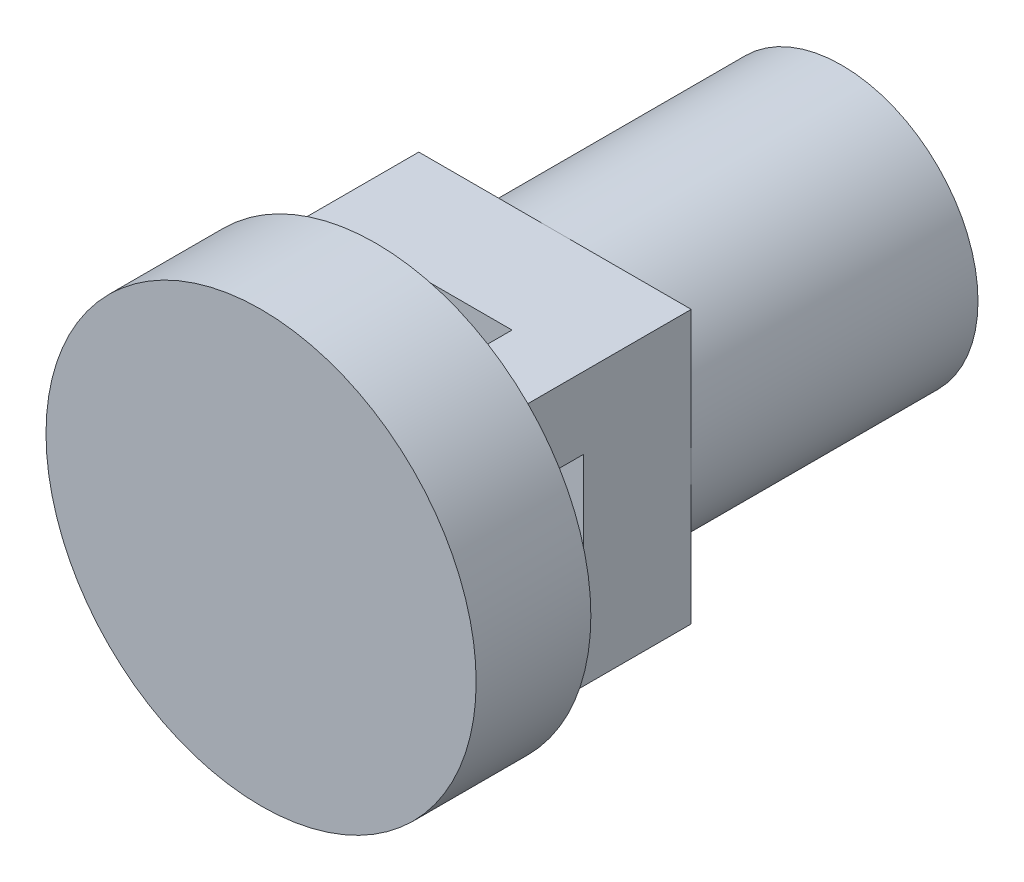
ISO-10303-21;
HEADER;
FILE_DESCRIPTION(('STEP AP214'),'2;1');
FILE_NAME('part.step','',(''),(''),'','','');
FILE_SCHEMA(('AUTOMOTIVE_DESIGN { 1 0 10303 214 1 1 1 1 }'));
ENDSEC;
DATA;
#1=APPLICATION_CONTEXT('core data for automotive mechanical design processes');
#2=APPLICATION_PROTOCOL_DEFINITION('international standard','automotive_design',2000,#1);
#3=PRODUCT_CONTEXT('',#1,'mechanical');
#4=PRODUCT('Part','Part','',(#3));
#5=PRODUCT_RELATED_PRODUCT_CATEGORY('part','',(#4));
#6=PRODUCT_DEFINITION_FORMATION('','',#4);
#7=PRODUCT_DEFINITION_CONTEXT('part definition',#1,'design');
#8=PRODUCT_DEFINITION('design','',#6,#7);
#9=PRODUCT_DEFINITION_SHAPE('','',#8);
#10=(LENGTH_UNIT() NAMED_UNIT(*) SI_UNIT(.MILLI.,.METRE.));
#11=(NAMED_UNIT(*) PLANE_ANGLE_UNIT() SI_UNIT($,.RADIAN.));
#12=(NAMED_UNIT(*) SI_UNIT($,.STERADIAN.) SOLID_ANGLE_UNIT());
#13=UNCERTAINTY_MEASURE_WITH_UNIT(LENGTH_MEASURE(1.E-05),#10,'distance_accuracy_value','');
#14=(GEOMETRIC_REPRESENTATION_CONTEXT(3) GLOBAL_UNCERTAINTY_ASSIGNED_CONTEXT((#13)) GLOBAL_UNIT_ASSIGNED_CONTEXT((#10,
#11,#12)) REPRESENTATION_CONTEXT('',''));
#15=CARTESIAN_POINT('',(0.,0.,0.));
#16=DIRECTION('',(0.,0.,1.));
#17=DIRECTION('',(1.,0.,0.));
#18=AXIS2_PLACEMENT_3D('',#15,#16,#17);
#19=CARTESIAN_POINT('',(3.00000508001016,3.00000508001016,-5.5));
#20=DIRECTION('',(0.,0.,1.));
#21=DIRECTION('',(1.,0.,0.));
#22=AXIS2_PLACEMENT_3D('',#19,#20,#21);
#23=CYLINDRICAL_SURFACE('',#22,0.601590178307734);
#24=CARTESIAN_POINT('',(3.00000508001016,3.00000508001016,-5.5));
#25=DIRECTION('',(0.,0.,-1.));
#26=DIRECTION('',(-1.,0.,0.));
#27=AXIS2_PLACEMENT_3D('',#24,#25,#26);
#28=CIRCLE('',#27,0.601590178307734);
#29=CARTESIAN_POINT('',(2.88467906805182,2.40957248131483,-5.5));
#30=VERTEX_POINT('',#29);
#31=CARTESIAN_POINT('',(2.88467906805182,3.59043767870549,-5.5));
#32=VERTEX_POINT('',#31);
#33=EDGE_CURVE('E236',#30,#32,#28,.T.);
#34=ORIENTED_EDGE('',*,*,#33,.F.);
#35=DIRECTION('',(0.,0.,1.));
#36=VECTOR('',#35,1.);
#37=CARTESIAN_POINT('',(2.88467906805182,2.40957248131483,-5.5));
#38=LINE('',#37,#36);
#39=CARTESIAN_POINT('',(2.88467906805182,2.40957248131483,-2.5));
#40=VERTEX_POINT('',#39);
#41=EDGE_CURVE('E538',#30,#40,#38,.T.);
#42=ORIENTED_EDGE('',*,*,#41,.T.);
#43=CARTESIAN_POINT('',(3.00000508001016,3.00000508001016,-2.5));
#44=DIRECTION('',(0.,0.,-1.));
#45=DIRECTION('',(-1.,0.,0.));
#46=AXIS2_PLACEMENT_3D('',#43,#44,#45);
#47=CIRCLE('',#46,0.601590178307734);
#48=CARTESIAN_POINT('',(2.88467906805182,3.59043767870549,-2.5));
#49=VERTEX_POINT('',#48);
#50=EDGE_CURVE('E247',#40,#49,#47,.T.);
#51=ORIENTED_EDGE('',*,*,#50,.T.);
#52=DIRECTION('',(0.,0.,1.));
#53=VECTOR('',#52,1.);
#54=CARTESIAN_POINT('',(2.88467906805182,3.59043767870549,-5.5));
#55=LINE('',#54,#53);
#56=EDGE_CURVE('E541',#49,#32,#55,.F.);
#57=ORIENTED_EDGE('',*,*,#56,.T.);
#58=EDGE_LOOP('',(#34,#42,#51,#57));
#59=FACE_BOUND('',#58,.T.);
#60=ADVANCED_FACE('F34',(#59),#23,.T.);
#61=CARTESIAN_POINT('',(3.00000508001016,3.00000508001016,-5.5));
#62=DIRECTION('',(0.,0.,-1.));
#63=DIRECTION('',(-1.,0.,0.));
#64=AXIS2_PLACEMENT_3D('',#61,#62,#63);
#65=PLANE('',#64);
#66=DIRECTION('',(0.,1.,0.));
#67=VECTOR('',#66,1.);
#68=CARTESIAN_POINT('',(2.88467906805182,2.16836654740901,-5.5));
#69=LINE('',#68,#67);
#70=CARTESIAN_POINT('',(2.88467906805182,2.71594913164705,-5.5));
#71=VERTEX_POINT('',#70);
#72=EDGE_CURVE('E560',#30,#71,#69,.T.);
#73=ORIENTED_EDGE('',*,*,#72,.F.);
#74=ORIENTED_EDGE('',*,*,#33,.T.);
#75=CARTESIAN_POINT('',(2.88467906805182,3.28406102837327,-5.5));
#76=VERTEX_POINT('',#75);
#77=EDGE_CURVE('E561',#76,#32,#69,.T.);
#78=ORIENTED_EDGE('',*,*,#77,.F.);
#79=CARTESIAN_POINT('',(3.00000508001016,3.00000508001016,-5.5));
#80=DIRECTION('',(0.,0.,-1.));
#81=DIRECTION('',(-1.,0.,0.));
#82=AXIS2_PLACEMENT_3D('',#79,#80,#81);
#83=CIRCLE('',#82,0.30657441320939);
#84=EDGE_CURVE('E245',#71,#76,#83,.T.);
#85=ORIENTED_EDGE('',*,*,#84,.F.);
#86=EDGE_LOOP('',(#73,#74,#78,#85));
#87=FACE_BOUND('',#86,.T.);
#88=ADVANCED_FACE('F488',(#87),#65,.T.);
#89=CARTESIAN_POINT('',(3.00000508001016,3.00000508001016,-2.5));
#90=DIRECTION('',(0.,0.,-1.));
#91=DIRECTION('',(-1.,0.,0.));
#92=AXIS2_PLACEMENT_3D('',#89,#90,#91);
#93=CYLINDRICAL_SURFACE('',#92,0.30657441320939);
#94=ORIENTED_EDGE('',*,*,#84,.T.);
#95=DIRECTION('',(0.,0.,-1.));
#96=VECTOR('',#95,1.);
#97=CARTESIAN_POINT('',(2.88467906805182,3.28406102837327,-2.5));
#98=LINE('',#97,#96);
#99=CARTESIAN_POINT('',(2.88467906805182,3.28406102837327,-2.5));
#100=VERTEX_POINT('',#99);
#101=EDGE_CURVE('E535',#76,#100,#98,.F.);
#102=ORIENTED_EDGE('',*,*,#101,.T.);
#103=CARTESIAN_POINT('',(3.00000508001016,3.00000508001016,-2.5));
#104=DIRECTION('',(0.,0.,-1.));
#105=DIRECTION('',(-1.,0.,0.));
#106=AXIS2_PLACEMENT_3D('',#103,#104,#105);
#107=CIRCLE('',#106,0.30657441320939);
#108=CARTESIAN_POINT('',(2.88467906805182,2.71594913164705,-2.5));
#109=VERTEX_POINT('',#108);
#110=EDGE_CURVE('E539',#109,#100,#107,.T.);
#111=ORIENTED_EDGE('',*,*,#110,.F.);
#112=DIRECTION('',(0.,0.,-1.));
#113=VECTOR('',#112,1.);
#114=CARTESIAN_POINT('',(2.88467906805182,2.71594913164705,-2.5));
#115=LINE('',#114,#113);
#116=EDGE_CURVE('E219',#109,#71,#115,.T.);
#117=ORIENTED_EDGE('',*,*,#116,.T.);
#118=EDGE_LOOP('',(#94,#102,#111,#117));
#119=FACE_BOUND('',#118,.T.);
#120=ADVANCED_FACE('F494',(#119),#93,.F.);
#121=CARTESIAN_POINT('',(0.,0.,-2.5));
#122=DIRECTION('',(0.,0.,-1.));
#123=DIRECTION('',(-1.,0.,0.));
#124=AXIS2_PLACEMENT_3D('',#121,#122,#123);
#125=PLANE('',#124);
#126=CARTESIAN_POINT('',(3.00000508001016,3.00000508001016,-2.5));
#127=DIRECTION('',(0.,0.,-1.));
#128=DIRECTION('',(-1.,0.,0.));
#129=AXIS2_PLACEMENT_3D('',#126,#127,#128);
#130=CIRCLE('',#129,1.9000508001016);
#131=CARTESIAN_POINT('',(1.09995427990856,3.00000508001016,-2.5));
#132=VERTEX_POINT('',#131);
#133=CARTESIAN_POINT('',(3.00000508001016,4.90005588011176,-2.5));
#134=VERTEX_POINT('',#133);
#135=EDGE_CURVE('E45',#132,#134,#130,.T.);
#136=ORIENTED_EDGE('',*,*,#135,.F.);
#137=DIRECTION('',(0.,1.,0.));
#138=VECTOR('',#137,1.);
#139=CARTESIAN_POINT('',(1.09995427990856,1.09995427990856,-2.5));
#140=LINE('',#139,#138);
#141=CARTESIAN_POINT('',(1.09995427990856,4.90005588011176,-2.5));
#142=VERTEX_POINT('',#141);
#143=EDGE_CURVE('E262',#132,#142,#140,.T.);
#144=ORIENTED_EDGE('',*,*,#143,.T.);
#145=DIRECTION('',(1.,0.,0.));
#146=VECTOR('',#145,1.);
#147=CARTESIAN_POINT('',(1.09995427990856,4.90005588011176,-2.5));
#148=LINE('',#147,#146);
#149=EDGE_CURVE('E263',#142,#134,#148,.T.);
#150=ORIENTED_EDGE('',*,*,#149,.T.);
#151=EDGE_LOOP('',(#136,#144,#150));
#152=FACE_BOUND('',#151,.T.);
#153=ADVANCED_FACE('F460',(#152),#125,.T.);
#154=CARTESIAN_POINT('',(4.90005588011176,3.00000508001016,-2.5));
#155=VERTEX_POINT('',#154);
#156=EDGE_CURVE('E11',#134,#155,#130,.T.);
#157=ORIENTED_EDGE('',*,*,#156,.F.);
#158=CARTESIAN_POINT('',(4.90005588011176,4.90005588011176,-2.5));
#159=VERTEX_POINT('',#158);
#160=EDGE_CURVE('E261',#134,#159,#148,.T.);
#161=ORIENTED_EDGE('',*,*,#160,.T.);
#162=DIRECTION('',(0.,-1.,0.));
#163=VECTOR('',#162,1.);
#164=CARTESIAN_POINT('',(4.90005588011176,1.09995427990856,-2.5));
#165=LINE('',#164,#163);
#166=EDGE_CURVE('E267',#159,#155,#165,.T.);
#167=ORIENTED_EDGE('',*,*,#166,.T.);
#168=EDGE_LOOP('',(#157,#161,#167));
#169=FACE_BOUND('',#168,.T.);
#170=ADVANCED_FACE('F453',(#169),#125,.T.);
#171=CARTESIAN_POINT('',(3.00000508001016,1.09995427990856,-2.5));
#172=VERTEX_POINT('',#171);
#173=EDGE_CURVE('E43',#155,#172,#130,.T.);
#174=ORIENTED_EDGE('',*,*,#173,.F.);
#175=CARTESIAN_POINT('',(4.90005588011176,1.09995427990856,-2.5));
#176=VERTEX_POINT('',#175);
#177=EDGE_CURVE('E266',#155,#176,#165,.T.);
#178=ORIENTED_EDGE('',*,*,#177,.T.);
#179=DIRECTION('',(-1.,0.,0.));
#180=VECTOR('',#179,1.);
#181=CARTESIAN_POINT('',(1.09995427990856,1.09995427990856,-2.5));
#182=LINE('',#181,#180);
#183=EDGE_CURVE('E271',#176,#172,#182,.T.);
#184=ORIENTED_EDGE('',*,*,#183,.T.);
#185=EDGE_LOOP('',(#174,#178,#184));
#186=FACE_BOUND('',#185,.T.);
#187=ADVANCED_FACE('F416',(#186),#125,.T.);
#188=CARTESIAN_POINT('',(3.00000508001016,3.00000508001016,0.));
#189=DIRECTION('',(0.,0.,1.));
#190=DIRECTION('',(1.,0.,0.));
#191=AXIS2_PLACEMENT_3D('',#188,#189,#190);
#192=PLANE('',#191);
#193=DIRECTION('',(0.,1.,0.));
#194=VECTOR('',#193,1.);
#195=CARTESIAN_POINT('',(3.90005588011176,3.90005588011176,0.));
#196=LINE('',#195,#194);
#197=CARTESIAN_POINT('',(3.90005588011176,3.90005588011176,0.));
#198=VERTEX_POINT('',#197);
#199=CARTESIAN_POINT('',(3.90005588011176,4.90005588011176,0.));
#200=VERTEX_POINT('',#199);
#201=EDGE_CURVE('E315',#198,#200,#196,.T.);
#202=ORIENTED_EDGE('',*,*,#201,.F.);
#203=DIRECTION('',(-1.,0.,0.));
#204=VECTOR('',#203,1.);
#205=CARTESIAN_POINT('',(3.90005588011176,3.90005588011176,0.));
#206=LINE('',#205,#204);
#207=CARTESIAN_POINT('',(4.90005588011176,3.90005588011176,0.));
#208=VERTEX_POINT('',#207);
#209=EDGE_CURVE('E320',#208,#198,#206,.T.);
#210=ORIENTED_EDGE('',*,*,#209,.F.);
#211=DIRECTION('',(0.,-1.,0.));
#212=VECTOR('',#211,1.);
#213=CARTESIAN_POINT('',(4.90005588011176,3.90005588011176,0.));
#214=LINE('',#213,#212);
#215=CARTESIAN_POINT('',(4.90005588011176,4.90005588011176,0.));
#216=VERTEX_POINT('',#215);
#217=EDGE_CURVE('E329',#216,#208,#214,.T.);
#218=ORIENTED_EDGE('',*,*,#217,.F.);
#219=DIRECTION('',(1.,0.,0.));
#220=VECTOR('',#219,1.);
#221=CARTESIAN_POINT('',(3.90005588011176,4.90005588011176,0.));
#222=LINE('',#221,#220);
#223=EDGE_CURVE('E326',#200,#216,#222,.T.);
#224=ORIENTED_EDGE('',*,*,#223,.F.);
#225=EDGE_LOOP('',(#202,#210,#218,#224));
#226=FACE_BOUND('',#225,.T.);
#227=DIRECTION('',(0.,1.,0.));
#228=VECTOR('',#227,1.);
#229=CARTESIAN_POINT('',(1.09995427990856,1.09995427990856,0.));
#230=LINE('',#229,#228);
#231=CARTESIAN_POINT('',(1.09995427990856,1.09995427990856,0.));
#232=VERTEX_POINT('',#231);
#233=CARTESIAN_POINT('',(1.09995427990856,2.09995427990856,0.));
#234=VERTEX_POINT('',#233);
#235=EDGE_CURVE('E375',#232,#234,#230,.T.);
#236=ORIENTED_EDGE('',*,*,#235,.F.);
#237=DIRECTION('',(-1.,0.,0.));
#238=VECTOR('',#237,1.);
#239=CARTESIAN_POINT('',(1.09995427990856,1.09995427990856,0.));
#240=LINE('',#239,#238);
#241=CARTESIAN_POINT('',(2.09995427990856,1.09995427990856,0.));
#242=VERTEX_POINT('',#241);
#243=EDGE_CURVE('E380',#242,#232,#240,.T.);
#244=ORIENTED_EDGE('',*,*,#243,.F.);
#245=DIRECTION('',(0.,-1.,0.));
#246=VECTOR('',#245,1.);
#247=CARTESIAN_POINT('',(2.09995427990856,1.09995427990856,0.));
#248=LINE('',#247,#246);
#249=CARTESIAN_POINT('',(2.09995427990856,2.09995427990856,0.));
#250=VERTEX_POINT('',#249);
#251=EDGE_CURVE('E389',#250,#242,#248,.T.);
#252=ORIENTED_EDGE('',*,*,#251,.F.);
#253=DIRECTION('',(1.,0.,0.));
#254=VECTOR('',#253,1.);
#255=CARTESIAN_POINT('',(1.09995427990856,2.09995427990856,0.));
#256=LINE('',#255,#254);
#257=EDGE_CURVE('E386',#234,#250,#256,.T.);
#258=ORIENTED_EDGE('',*,*,#257,.F.);
#259=EDGE_LOOP('',(#236,#244,#252,#258));
#260=FACE_BOUND('',#259,.T.);
#261=CARTESIAN_POINT('',(3.00000508001016,3.00000508001016,0.));
#262=DIRECTION('',(0.,0.,1.));
#263=DIRECTION('',(1.,0.,0.));
#264=AXIS2_PLACEMENT_3D('',#261,#262,#263);
#265=CIRCLE('',#264,3.00000508001016);
#266=CARTESIAN_POINT('',(6.00001016002032,3.00000508001016,0.));
#267=VERTEX_POINT('',#266);
#268=EDGE_CURVE('E38',#267,#267,#265,.T.);
#269=ORIENTED_EDGE('',*,*,#268,.F.);
#270=EDGE_LOOP('',(#269));
#271=FACE_BOUND('',#270,.T.);
#272=DIRECTION('',(0.,1.,0.));
#273=VECTOR('',#272,1.);
#274=CARTESIAN_POINT('',(1.09995427990856,3.90005588011176,0.));
#275=LINE('',#274,#273);
#276=CARTESIAN_POINT('',(1.09995427990856,3.90005588011176,0.));
#277=VERTEX_POINT('',#276);
#278=CARTESIAN_POINT('',(1.09995427990856,4.90005588011176,0.));
#279=VERTEX_POINT('',#278);
#280=EDGE_CURVE('E345',#277,#279,#275,.T.);
#281=ORIENTED_EDGE('',*,*,#280,.F.);
#282=DIRECTION('',(-1.,0.,0.));
#283=VECTOR('',#282,1.);
#284=CARTESIAN_POINT('',(1.09995427990856,3.90005588011176,0.));
#285=LINE('',#284,#283);
#286=CARTESIAN_POINT('',(2.09995427990856,3.90005588011176,0.));
#287=VERTEX_POINT('',#286);
#288=EDGE_CURVE('E350',#287,#277,#285,.T.);
#289=ORIENTED_EDGE('',*,*,#288,.F.);
#290=DIRECTION('',(0.,-1.,0.));
#291=VECTOR('',#290,1.);
#292=CARTESIAN_POINT('',(2.09995427990856,3.90005588011176,0.));
#293=LINE('',#292,#291);
#294=CARTESIAN_POINT('',(2.09995427990856,4.90005588011176,0.));
#295=VERTEX_POINT('',#294);
#296=EDGE_CURVE('E359',#295,#287,#293,.T.);
#297=ORIENTED_EDGE('',*,*,#296,.F.);
#298=DIRECTION('',(1.,0.,0.));
#299=VECTOR('',#298,1.);
#300=CARTESIAN_POINT('',(1.09995427990856,4.90005588011176,0.));
#301=LINE('',#300,#299);
#302=EDGE_CURVE('E356',#279,#295,#301,.T.);
#303=ORIENTED_EDGE('',*,*,#302,.F.);
#304=EDGE_LOOP('',(#281,#289,#297,#303));
#305=FACE_BOUND('',#304,.T.);
#306=DIRECTION('',(0.,1.,0.));
#307=VECTOR('',#306,1.);
#308=CARTESIAN_POINT('',(3.90005588011176,1.09995427990856,0.));
#309=LINE('',#308,#307);
#310=CARTESIAN_POINT('',(3.90005588011176,1.09995427990856,0.));
#311=VERTEX_POINT('',#310);
#312=CARTESIAN_POINT('',(3.90005588011176,2.09995427990856,0.));
#313=VERTEX_POINT('',#312);
#314=EDGE_CURVE('E274',#311,#313,#309,.T.);
#315=ORIENTED_EDGE('',*,*,#314,.F.);
#316=DIRECTION('',(-1.,0.,0.));
#317=VECTOR('',#316,1.);
#318=CARTESIAN_POINT('',(3.90005588011176,1.09995427990856,0.));
#319=LINE('',#318,#317);
#320=CARTESIAN_POINT('',(4.90005588011176,1.09995427990856,0.));
#321=VERTEX_POINT('',#320);
#322=EDGE_CURVE('E290',#321,#311,#319,.T.);
#323=ORIENTED_EDGE('',*,*,#322,.F.);
#324=DIRECTION('',(0.,-1.,0.));
#325=VECTOR('',#324,1.);
#326=CARTESIAN_POINT('',(4.90005588011176,1.09995427990856,0.));
#327=LINE('',#326,#325);
#328=CARTESIAN_POINT('',(4.90005588011176,2.09995427990856,0.));
#329=VERTEX_POINT('',#328);
#330=EDGE_CURVE('E299',#329,#321,#327,.T.);
#331=ORIENTED_EDGE('',*,*,#330,.F.);
#332=DIRECTION('',(1.,0.,0.));
#333=VECTOR('',#332,1.);
#334=CARTESIAN_POINT('',(3.90005588011176,2.09995427990856,0.));
#335=LINE('',#334,#333);
#336=EDGE_CURVE('E296',#313,#329,#335,.T.);
#337=ORIENTED_EDGE('',*,*,#336,.F.);
#338=EDGE_LOOP('',(#315,#323,#331,#337));
#339=FACE_BOUND('',#338,.T.);
#340=ADVANCED_FACE('F413',(#226,#260,#271,#305,#339),#192,.F.);
#341=CARTESIAN_POINT('',(3.00000508001016,3.00000508001016,1.6));
#342=DIRECTION('',(0.,0.,-1.));
#343=DIRECTION('',(-1.,0.,0.));
#344=AXIS2_PLACEMENT_3D('',#341,#342,#343);
#345=CYLINDRICAL_SURFACE('',#344,3.00000508001016);
#346=CARTESIAN_POINT('',(3.00000508001016,3.00000508001016,1.6));
#347=DIRECTION('',(0.,0.,1.));
#348=DIRECTION('',(1.,0.,0.));
#349=AXIS2_PLACEMENT_3D('',#346,#347,#348);
#350=CIRCLE('',#349,3.00000508001016);
#351=CARTESIAN_POINT('',(6.00001016002032,3.00000508001016,1.6));
#352=VERTEX_POINT('',#351);
#353=EDGE_CURVE('E404',#352,#352,#350,.T.);
#354=ORIENTED_EDGE('',*,*,#353,.F.);
#355=EDGE_LOOP('',(#354));
#356=FACE_BOUND('',#355,.T.);
#357=ORIENTED_EDGE('',*,*,#268,.T.);
#358=EDGE_LOOP('',(#357));
#359=FACE_BOUND('',#358,.T.);
#360=ADVANCED_FACE('F36',(#356,#359),#345,.T.);
#361=CARTESIAN_POINT('',(3.00000508001016,3.00000508001016,1.6));
#362=DIRECTION('',(0.,0.,1.));
#363=DIRECTION('',(1.,0.,0.));
#364=AXIS2_PLACEMENT_3D('',#361,#362,#363);
#365=PLANE('',#364);
#366=ORIENTED_EDGE('',*,*,#353,.T.);
#367=EDGE_LOOP('',(#366));
#368=FACE_BOUND('',#367,.T.);
#369=ADVANCED_FACE('F685',(#368),#365,.T.);
#370=CARTESIAN_POINT('',(1.09995427990856,1.09995427990856,-1.));
#371=DIRECTION('',(1.,0.,0.));
#372=DIRECTION('',(0.,0.,-1.));
#373=AXIS2_PLACEMENT_3D('',#370,#371,#372);
#374=PLANE('',#373);
#375=ORIENTED_EDGE('',*,*,#235,.T.);
#376=DIRECTION('',(0.,0.,1.));
#377=VECTOR('',#376,1.);
#378=CARTESIAN_POINT('',(1.09995427990856,2.09995427990856,-1.));
#379=LINE('',#378,#377);
#380=CARTESIAN_POINT('',(1.09995427990856,2.09995427990856,-1.));
#381=VERTEX_POINT('',#380);
#382=EDGE_CURVE('E402',#381,#234,#379,.T.);
#383=ORIENTED_EDGE('',*,*,#382,.F.);
#384=DIRECTION('',(0.,1.,0.));
#385=VECTOR('',#384,1.);
#386=CARTESIAN_POINT('',(1.09995427990856,1.09995427990856,-1.));
#387=LINE('',#386,#385);
#388=CARTESIAN_POINT('',(1.09995427990856,3.90005588011176,-1.));
#389=VERTEX_POINT('',#388);
#390=EDGE_CURVE('E255',#381,#389,#387,.T.);
#391=ORIENTED_EDGE('',*,*,#390,.T.);
#392=DIRECTION('',(0.,0.,1.));
#393=VECTOR('',#392,1.);
#394=CARTESIAN_POINT('',(1.09995427990856,3.90005588011176,-1.));
#395=LINE('',#394,#393);
#396=EDGE_CURVE('E353',#389,#277,#395,.T.);
#397=ORIENTED_EDGE('',*,*,#396,.T.);
#398=ORIENTED_EDGE('',*,*,#280,.T.);
#399=DIRECTION('',(0.,0.,1.));
#400=VECTOR('',#399,1.);
#401=CARTESIAN_POINT('',(1.09995427990856,4.90005588011176,-1.));
#402=LINE('',#401,#400);
#403=EDGE_CURVE('E372',#142,#279,#402,.T.);
#404=ORIENTED_EDGE('',*,*,#403,.F.);
#405=ORIENTED_EDGE('',*,*,#143,.F.);
#406=CARTESIAN_POINT('',(1.09995427990856,1.09995427990856,-2.5));
#407=VERTEX_POINT('',#406);
#408=EDGE_CURVE('E259',#407,#132,#140,.T.);
#409=ORIENTED_EDGE('',*,*,#408,.F.);
#410=DIRECTION('',(0.,0.,1.));
#411=VECTOR('',#410,1.);
#412=CARTESIAN_POINT('',(1.09995427990856,1.09995427990856,-1.));
#413=LINE('',#412,#411);
#414=EDGE_CURVE('E383',#407,#232,#413,.T.);
#415=ORIENTED_EDGE('',*,*,#414,.T.);
#416=EDGE_LOOP('',(#375,#383,#391,#397,#398,#404,#405,#409,#415));
#417=FACE_BOUND('',#416,.T.);
#418=ADVANCED_FACE('F440',(#417),#374,.F.);
#419=CARTESIAN_POINT('',(1.09995427990856,2.09995427990856,-1.));
#420=DIRECTION('',(0.,-1.,0.));
#421=DIRECTION('',(0.,0.,-1.));
#422=AXIS2_PLACEMENT_3D('',#419,#420,#421);
#423=PLANE('',#422);
#424=ORIENTED_EDGE('',*,*,#257,.T.);
#425=DIRECTION('',(0.,0.,1.));
#426=VECTOR('',#425,1.);
#427=CARTESIAN_POINT('',(2.09995427990856,2.09995427990856,-1.));
#428=LINE('',#427,#426);
#429=CARTESIAN_POINT('',(2.09995427990856,2.09995427990856,-1.));
#430=VERTEX_POINT('',#429);
#431=EDGE_CURVE('E399',#430,#250,#428,.T.);
#432=ORIENTED_EDGE('',*,*,#431,.F.);
#433=DIRECTION('',(1.,0.,0.));
#434=VECTOR('',#433,1.);
#435=CARTESIAN_POINT('',(1.09995427990856,2.09995427990856,-1.));
#436=LINE('',#435,#434);
#437=EDGE_CURVE('E376',#381,#430,#436,.T.);
#438=ORIENTED_EDGE('',*,*,#437,.F.);
#439=ORIENTED_EDGE('',*,*,#382,.T.);
#440=EDGE_LOOP('',(#424,#432,#438,#439));
#441=FACE_BOUND('',#440,.T.);
#442=ADVANCED_FACE('F437',(#441),#423,.F.);
#443=CARTESIAN_POINT('',(2.09995427990856,1.09995427990856,-1.));
#444=DIRECTION('',(-1.,0.,0.));
#445=DIRECTION('',(0.,0.,1.));
#446=AXIS2_PLACEMENT_3D('',#443,#444,#445);
#447=PLANE('',#446);
#448=ORIENTED_EDGE('',*,*,#251,.T.);
#449=DIRECTION('',(0.,0.,1.));
#450=VECTOR('',#449,1.);
#451=CARTESIAN_POINT('',(2.09995427990856,1.09995427990856,-1.));
#452=LINE('',#451,#450);
#453=CARTESIAN_POINT('',(2.09995427990856,1.09995427990856,-1.));
#454=VERTEX_POINT('',#453);
#455=EDGE_CURVE('E396',#454,#242,#452,.T.);
#456=ORIENTED_EDGE('',*,*,#455,.F.);
#457=DIRECTION('',(0.,-1.,0.));
#458=VECTOR('',#457,1.);
#459=CARTESIAN_POINT('',(2.09995427990856,1.09995427990856,-1.));
#460=LINE('',#459,#458);
#461=EDGE_CURVE('E379',#430,#454,#460,.T.);
#462=ORIENTED_EDGE('',*,*,#461,.F.);
#463=ORIENTED_EDGE('',*,*,#431,.T.);
#464=EDGE_LOOP('',(#448,#456,#462,#463));
#465=FACE_BOUND('',#464,.T.);
#466=ADVANCED_FACE('F434',(#465),#447,.F.);
#467=CARTESIAN_POINT('',(1.09995427990856,1.09995427990856,-1.));
#468=DIRECTION('',(0.,1.,0.));
#469=DIRECTION('',(0.,0.,1.));
#470=AXIS2_PLACEMENT_3D('',#467,#468,#469);
#471=PLANE('',#470);
#472=ORIENTED_EDGE('',*,*,#243,.T.);
#473=ORIENTED_EDGE('',*,*,#414,.F.);
#474=EDGE_CURVE('E270',#172,#407,#182,.T.);
#475=ORIENTED_EDGE('',*,*,#474,.F.);
#476=ORIENTED_EDGE('',*,*,#183,.F.);
#477=DIRECTION('',(0.,0.,1.));
#478=VECTOR('',#477,1.);
#479=CARTESIAN_POINT('',(4.90005588011176,1.09995427990856,-1.));
#480=LINE('',#479,#478);
#481=EDGE_CURVE('E306',#176,#321,#480,.T.);
#482=ORIENTED_EDGE('',*,*,#481,.T.);
#483=ORIENTED_EDGE('',*,*,#322,.T.);
#484=DIRECTION('',(0.,0.,1.));
#485=VECTOR('',#484,1.);
#486=CARTESIAN_POINT('',(3.90005588011176,1.09995427990856,-1.));
#487=LINE('',#486,#485);
#488=CARTESIAN_POINT('',(3.90005588011176,1.09995427990856,-1.));
#489=VERTEX_POINT('',#488);
#490=EDGE_CURVE('E293',#489,#311,#487,.T.);
#491=ORIENTED_EDGE('',*,*,#490,.F.);
#492=DIRECTION('',(-1.,0.,0.));
#493=VECTOR('',#492,1.);
#494=CARTESIAN_POINT('',(1.09995427990856,1.09995427990856,-1.));
#495=LINE('',#494,#493);
#496=EDGE_CURVE('E283',#489,#454,#495,.T.);
#497=ORIENTED_EDGE('',*,*,#496,.T.);
#498=ORIENTED_EDGE('',*,*,#455,.T.);
#499=EDGE_LOOP('',(#472,#473,#475,#476,#482,#483,#491,#497,#498));
#500=FACE_BOUND('',#499,.T.);
#501=ADVANCED_FACE('F422',(#500),#471,.F.);
#502=CARTESIAN_POINT('',(1.09995427990856,4.90005588011176,-1.));
#503=DIRECTION('',(0.,-1.,0.));
#504=DIRECTION('',(0.,0.,-1.));
#505=AXIS2_PLACEMENT_3D('',#502,#503,#504);
#506=PLANE('',#505);
#507=ORIENTED_EDGE('',*,*,#302,.T.);
#508=DIRECTION('',(0.,0.,1.));
#509=VECTOR('',#508,1.);
#510=CARTESIAN_POINT('',(2.09995427990856,4.90005588011176,-1.));
#511=LINE('',#510,#509);
#512=CARTESIAN_POINT('',(2.09995427990856,4.90005588011176,-1.));
#513=VERTEX_POINT('',#512);
#514=EDGE_CURVE('E369',#513,#295,#511,.T.);
#515=ORIENTED_EDGE('',*,*,#514,.F.);
#516=DIRECTION('',(1.,0.,0.));
#517=VECTOR('',#516,1.);
#518=CARTESIAN_POINT('',(1.09995427990856,4.90005588011176,-1.));
#519=LINE('',#518,#517);
#520=CARTESIAN_POINT('',(3.90005588011176,4.90005588011176,-1.));
#521=VERTEX_POINT('',#520);
#522=EDGE_CURVE('E277',#513,#521,#519,.T.);
#523=ORIENTED_EDGE('',*,*,#522,.T.);
#524=DIRECTION('',(0.,0.,1.));
#525=VECTOR('',#524,1.);
#526=CARTESIAN_POINT('',(3.90005588011176,4.90005588011176,-1.));
#527=LINE('',#526,#525);
#528=EDGE_CURVE('E342',#521,#200,#527,.T.);
#529=ORIENTED_EDGE('',*,*,#528,.T.);
#530=ORIENTED_EDGE('',*,*,#223,.T.);
#531=DIRECTION('',(0.,0.,1.));
#532=VECTOR('',#531,1.);
#533=CARTESIAN_POINT('',(4.90005588011176,4.90005588011176,-1.));
#534=LINE('',#533,#532);
#535=EDGE_CURVE('E339',#159,#216,#534,.T.);
#536=ORIENTED_EDGE('',*,*,#535,.F.);
#537=ORIENTED_EDGE('',*,*,#160,.F.);
#538=ORIENTED_EDGE('',*,*,#149,.F.);
#539=ORIENTED_EDGE('',*,*,#403,.T.);
#540=EDGE_LOOP('',(#507,#515,#523,#529,#530,#536,#537,#538,#539));
#541=FACE_BOUND('',#540,.T.);
#542=ADVANCED_FACE('F458',(#541),#506,.F.);
#543=CARTESIAN_POINT('',(2.09995427990856,3.90005588011176,-1.));
#544=DIRECTION('',(-1.,0.,0.));
#545=DIRECTION('',(0.,0.,1.));
#546=AXIS2_PLACEMENT_3D('',#543,#544,#545);
#547=PLANE('',#546);
#548=ORIENTED_EDGE('',*,*,#296,.T.);
#549=DIRECTION('',(0.,0.,1.));
#550=VECTOR('',#549,1.);
#551=CARTESIAN_POINT('',(2.09995427990856,3.90005588011176,-1.));
#552=LINE('',#551,#550);
#553=CARTESIAN_POINT('',(2.09995427990856,3.90005588011176,-1.));
#554=VERTEX_POINT('',#553);
#555=EDGE_CURVE('E366',#554,#287,#552,.T.);
#556=ORIENTED_EDGE('',*,*,#555,.F.);
#557=DIRECTION('',(0.,-1.,0.));
#558=VECTOR('',#557,1.);
#559=CARTESIAN_POINT('',(2.09995427990856,3.90005588011176,-1.));
#560=LINE('',#559,#558);
#561=EDGE_CURVE('E346',#513,#554,#560,.T.);
#562=ORIENTED_EDGE('',*,*,#561,.F.);
#563=ORIENTED_EDGE('',*,*,#514,.T.);
#564=EDGE_LOOP('',(#548,#556,#562,#563));
#565=FACE_BOUND('',#564,.T.);
#566=ADVANCED_FACE('F464',(#565),#547,.F.);
#567=CARTESIAN_POINT('',(1.09995427990856,3.90005588011176,-1.));
#568=DIRECTION('',(0.,1.,0.));
#569=DIRECTION('',(0.,0.,1.));
#570=AXIS2_PLACEMENT_3D('',#567,#568,#569);
#571=PLANE('',#570);
#572=ORIENTED_EDGE('',*,*,#288,.T.);
#573=ORIENTED_EDGE('',*,*,#396,.F.);
#574=DIRECTION('',(-1.,0.,0.));
#575=VECTOR('',#574,1.);
#576=CARTESIAN_POINT('',(1.09995427990856,3.90005588011176,-1.));
#577=LINE('',#576,#575);
#578=EDGE_CURVE('E349',#554,#389,#577,.T.);
#579=ORIENTED_EDGE('',*,*,#578,.F.);
#580=ORIENTED_EDGE('',*,*,#555,.T.);
#581=EDGE_LOOP('',(#572,#573,#579,#580));
#582=FACE_BOUND('',#581,.T.);
#583=ADVANCED_FACE('F737',(#582),#571,.F.);
#584=CARTESIAN_POINT('',(3.90005588011176,3.90005588011176,-1.));
#585=DIRECTION('',(1.,0.,0.));
#586=DIRECTION('',(0.,0.,-1.));
#587=AXIS2_PLACEMENT_3D('',#584,#585,#586);
#588=PLANE('',#587);
#589=ORIENTED_EDGE('',*,*,#201,.T.);
#590=ORIENTED_EDGE('',*,*,#528,.F.);
#591=DIRECTION('',(0.,1.,0.));
#592=VECTOR('',#591,1.);
#593=CARTESIAN_POINT('',(3.90005588011176,3.90005588011176,-1.));
#594=LINE('',#593,#592);
#595=CARTESIAN_POINT('',(3.90005588011176,3.90005588011176,-1.));
#596=VERTEX_POINT('',#595);
#597=EDGE_CURVE('E316',#596,#521,#594,.T.);
#598=ORIENTED_EDGE('',*,*,#597,.F.);
#599=DIRECTION('',(0.,0.,1.));
#600=VECTOR('',#599,1.);
#601=CARTESIAN_POINT('',(3.90005588011176,3.90005588011176,-1.));
#602=LINE('',#601,#600);
#603=EDGE_CURVE('E323',#596,#198,#602,.T.);
#604=ORIENTED_EDGE('',*,*,#603,.T.);
#605=EDGE_LOOP('',(#589,#590,#598,#604));
#606=FACE_BOUND('',#605,.T.);
#607=ADVANCED_FACE('F468',(#606),#588,.F.);
#608=CARTESIAN_POINT('',(4.90005588011176,3.90005588011176,-1.));
#609=DIRECTION('',(-1.,0.,0.));
#610=DIRECTION('',(0.,0.,1.));
#611=AXIS2_PLACEMENT_3D('',#608,#609,#610);
#612=PLANE('',#611);
#613=ORIENTED_EDGE('',*,*,#217,.T.);
#614=DIRECTION('',(0.,0.,1.));
#615=VECTOR('',#614,1.);
#616=CARTESIAN_POINT('',(4.90005588011176,3.90005588011176,-1.));
#617=LINE('',#616,#615);
#618=CARTESIAN_POINT('',(4.90005588011176,3.90005588011176,-1.));
#619=VERTEX_POINT('',#618);
#620=EDGE_CURVE('E336',#619,#208,#617,.T.);
#621=ORIENTED_EDGE('',*,*,#620,.F.);
#622=DIRECTION('',(0.,-1.,0.));
#623=VECTOR('',#622,1.);
#624=CARTESIAN_POINT('',(4.90005588011176,1.09995427990856,-1.));
#625=LINE('',#624,#623);
#626=CARTESIAN_POINT('',(4.90005588011176,2.09995427990856,-1.));
#627=VERTEX_POINT('',#626);
#628=EDGE_CURVE('E280',#619,#627,#625,.T.);
#629=ORIENTED_EDGE('',*,*,#628,.T.);
#630=DIRECTION('',(0.,0.,1.));
#631=VECTOR('',#630,1.);
#632=CARTESIAN_POINT('',(4.90005588011176,2.09995427990856,-1.));
#633=LINE('',#632,#631);
#634=EDGE_CURVE('E309',#627,#329,#633,.T.);
#635=ORIENTED_EDGE('',*,*,#634,.T.);
#636=ORIENTED_EDGE('',*,*,#330,.T.);
#637=ORIENTED_EDGE('',*,*,#481,.F.);
#638=ORIENTED_EDGE('',*,*,#177,.F.);
#639=ORIENTED_EDGE('',*,*,#166,.F.);
#640=ORIENTED_EDGE('',*,*,#535,.T.);
#641=EDGE_LOOP('',(#613,#621,#629,#635,#636,#637,#638,#639,#640));
#642=FACE_BOUND('',#641,.T.);
#643=ADVANCED_FACE('F475',(#642),#612,.F.);
#644=CARTESIAN_POINT('',(3.90005588011176,3.90005588011176,-1.));
#645=DIRECTION('',(0.,1.,0.));
#646=DIRECTION('',(0.,0.,1.));
#647=AXIS2_PLACEMENT_3D('',#644,#645,#646);
#648=PLANE('',#647);
#649=ORIENTED_EDGE('',*,*,#209,.T.);
#650=ORIENTED_EDGE('',*,*,#603,.F.);
#651=DIRECTION('',(-1.,0.,0.));
#652=VECTOR('',#651,1.);
#653=CARTESIAN_POINT('',(3.90005588011176,3.90005588011176,-1.));
#654=LINE('',#653,#652);
#655=EDGE_CURVE('E319',#619,#596,#654,.T.);
#656=ORIENTED_EDGE('',*,*,#655,.F.);
#657=ORIENTED_EDGE('',*,*,#620,.T.);
#658=EDGE_LOOP('',(#649,#650,#656,#657));
#659=FACE_BOUND('',#658,.T.);
#660=ADVANCED_FACE('F471',(#659),#648,.F.);
#661=CARTESIAN_POINT('',(3.90005588011176,1.09995427990856,-1.));
#662=DIRECTION('',(1.,0.,0.));
#663=DIRECTION('',(0.,0.,-1.));
#664=AXIS2_PLACEMENT_3D('',#661,#662,#663);
#665=PLANE('',#664);
#666=ORIENTED_EDGE('',*,*,#314,.T.);
#667=DIRECTION('',(0.,0.,1.));
#668=VECTOR('',#667,1.);
#669=CARTESIAN_POINT('',(3.90005588011176,2.09995427990856,-1.));
#670=LINE('',#669,#668);
#671=CARTESIAN_POINT('',(3.90005588011176,2.09995427990856,-1.));
#672=VERTEX_POINT('',#671);
#673=EDGE_CURVE('E312',#672,#313,#670,.T.);
#674=ORIENTED_EDGE('',*,*,#673,.F.);
#675=DIRECTION('',(0.,1.,0.));
#676=VECTOR('',#675,1.);
#677=CARTESIAN_POINT('',(3.90005588011176,1.09995427990856,-1.));
#678=LINE('',#677,#676);
#679=EDGE_CURVE('E286',#489,#672,#678,.T.);
#680=ORIENTED_EDGE('',*,*,#679,.F.);
#681=ORIENTED_EDGE('',*,*,#490,.T.);
#682=EDGE_LOOP('',(#666,#674,#680,#681));
#683=FACE_BOUND('',#682,.T.);
#684=ADVANCED_FACE('F426',(#683),#665,.F.);
#685=CARTESIAN_POINT('',(3.90005588011176,2.09995427990856,-1.));
#686=DIRECTION('',(0.,-1.,0.));
#687=DIRECTION('',(0.,0.,-1.));
#688=AXIS2_PLACEMENT_3D('',#685,#686,#687);
#689=PLANE('',#688);
#690=ORIENTED_EDGE('',*,*,#336,.T.);
#691=ORIENTED_EDGE('',*,*,#634,.F.);
#692=DIRECTION('',(1.,0.,0.));
#693=VECTOR('',#692,1.);
#694=CARTESIAN_POINT('',(3.90005588011176,2.09995427990856,-1.));
#695=LINE('',#694,#693);
#696=EDGE_CURVE('E289',#672,#627,#695,.T.);
#697=ORIENTED_EDGE('',*,*,#696,.F.);
#698=ORIENTED_EDGE('',*,*,#673,.T.);
#699=EDGE_LOOP('',(#690,#691,#697,#698));
#700=FACE_BOUND('',#699,.T.);
#701=ADVANCED_FACE('F477',(#700),#689,.F.);
#702=CARTESIAN_POINT('',(0.,0.,-1.));
#703=DIRECTION('',(0.,0.,-1.));
#704=DIRECTION('',(-1.,0.,0.));
#705=AXIS2_PLACEMENT_3D('',#702,#703,#704);
#706=PLANE('',#705);
#707=ORIENTED_EDGE('',*,*,#390,.F.);
#708=ORIENTED_EDGE('',*,*,#437,.T.);
#709=ORIENTED_EDGE('',*,*,#461,.T.);
#710=ORIENTED_EDGE('',*,*,#496,.F.);
#711=ORIENTED_EDGE('',*,*,#679,.T.);
#712=ORIENTED_EDGE('',*,*,#696,.T.);
#713=ORIENTED_EDGE('',*,*,#628,.F.);
#714=ORIENTED_EDGE('',*,*,#655,.T.);
#715=ORIENTED_EDGE('',*,*,#597,.T.);
#716=ORIENTED_EDGE('',*,*,#522,.F.);
#717=ORIENTED_EDGE('',*,*,#561,.T.);
#718=ORIENTED_EDGE('',*,*,#578,.T.);
#719=EDGE_LOOP('',(#707,#708,#709,#710,#711,#712,#713,#714,#715,#716,#717,#718));
#720=FACE_BOUND('',#719,.T.);
#721=ADVANCED_FACE('F430',(#720),#706,.F.);
#722=EDGE_CURVE('E258',#172,#132,#130,.T.);
#723=ORIENTED_EDGE('',*,*,#722,.F.);
#724=ORIENTED_EDGE('',*,*,#474,.T.);
#725=ORIENTED_EDGE('',*,*,#408,.T.);
#726=EDGE_LOOP('',(#723,#724,#725));
#727=FACE_BOUND('',#726,.T.);
#728=ADVANCED_FACE('F484',(#727),#125,.T.);
#729=CARTESIAN_POINT('',(3.00000508001016,3.00000508001016,-6.5));
#730=DIRECTION('',(0.,0.,1.));
#731=DIRECTION('',(1.,0.,0.));
#732=AXIS2_PLACEMENT_3D('',#729,#730,#731);
#733=CYLINDRICAL_SURFACE('',#732,1.9000508001016);
#734=CARTESIAN_POINT('',(3.00000508001016,3.00000508001016,-6.5));
#735=DIRECTION('',(0.,0.,-1.));
#736=DIRECTION('',(-1.,0.,0.));
#737=AXIS2_PLACEMENT_3D('',#734,#735,#736);
#738=CIRCLE('',#737,1.9000508001016);
#739=CARTESIAN_POINT('',(1.09995427990856,3.00000508001016,-6.5));
#740=VERTEX_POINT('',#739);
#741=EDGE_CURVE('E253',#740,#740,#738,.T.);
#742=ORIENTED_EDGE('',*,*,#741,.F.);
#743=EDGE_LOOP('',(#742));
#744=FACE_BOUND('',#743,.T.);
#745=ORIENTED_EDGE('',*,*,#135,.T.);
#746=ORIENTED_EDGE('',*,*,#156,.T.);
#747=ORIENTED_EDGE('',*,*,#173,.T.);
#748=ORIENTED_EDGE('',*,*,#722,.T.);
#749=EDGE_LOOP('',(#745,#746,#747,#748));
#750=FACE_BOUND('',#749,.T.);
#751=ADVANCED_FACE('F449',(#744,#750),#733,.T.);
#752=CARTESIAN_POINT('',(3.00000508001016,3.00000508001016,-6.5));
#753=DIRECTION('',(0.,0.,-1.));
#754=DIRECTION('',(-1.,0.,0.));
#755=AXIS2_PLACEMENT_3D('',#752,#753,#754);
#756=PLANE('',#755);
#757=CARTESIAN_POINT('',(3.00000508001016,3.00000508001016,-6.5));
#758=DIRECTION('',(0.,0.,-1.));
#759=DIRECTION('',(-1.,0.,0.));
#760=AXIS2_PLACEMENT_3D('',#757,#758,#759);
#761=CIRCLE('',#760,1.6151521962782);
#762=CARTESIAN_POINT('',(1.38485288373196,3.00000508001016,-6.5));
#763=VERTEX_POINT('',#762);
#764=EDGE_CURVE('E235',#763,#763,#761,.T.);
#765=ORIENTED_EDGE('',*,*,#764,.F.);
#766=EDGE_LOOP('',(#765));
#767=FACE_BOUND('',#766,.T.);
#768=ORIENTED_EDGE('',*,*,#741,.T.);
#769=EDGE_LOOP('',(#768));
#770=FACE_BOUND('',#769,.T.);
#771=ADVANCED_FACE('F511',(#767,#770),#756,.T.);
#772=CARTESIAN_POINT('',(3.00000508001016,3.00000508001016,-2.5));
#773=DIRECTION('',(0.,0.,-1.));
#774=DIRECTION('',(-1.,0.,0.));
#775=AXIS2_PLACEMENT_3D('',#772,#773,#774);
#776=CYLINDRICAL_SURFACE('',#775,1.6151521962782);
#777=CARTESIAN_POINT('',(3.00000508001016,3.00000508001016,-2.5));
#778=DIRECTION('',(0.,0.,-1.));
#779=DIRECTION('',(-1.,0.,0.));
#780=AXIS2_PLACEMENT_3D('',#777,#778,#779);
#781=CIRCLE('',#780,1.6151521962782);
#782=CARTESIAN_POINT('',(1.38485288373196,3.00000508001016,-2.5));
#783=VERTEX_POINT('',#782);
#784=EDGE_CURVE('E239',#783,#783,#781,.T.);
#785=ORIENTED_EDGE('',*,*,#784,.F.);
#786=EDGE_LOOP('',(#785));
#787=FACE_BOUND('',#786,.T.);
#788=ORIENTED_EDGE('',*,*,#764,.T.);
#789=EDGE_LOOP('',(#788));
#790=FACE_BOUND('',#789,.T.);
#791=ADVANCED_FACE('F506',(#787,#790),#776,.F.);
#792=CARTESIAN_POINT('',(3.00000508001016,3.00000508001016,-2.5));
#793=DIRECTION('',(0.,0.,-1.));
#794=DIRECTION('',(-1.,0.,0.));
#795=AXIS2_PLACEMENT_3D('',#792,#793,#794);
#796=PLANE('',#795);
#797=ORIENTED_EDGE('',*,*,#50,.F.);
#798=DIRECTION('',(0.,1.,0.));
#799=VECTOR('',#798,1.);
#800=CARTESIAN_POINT('',(2.88467906805182,2.16836654740901,-2.5));
#801=LINE('',#800,#799);
#802=EDGE_CURVE('E52',#40,#109,#801,.T.);
#803=ORIENTED_EDGE('',*,*,#802,.T.);
#804=ORIENTED_EDGE('',*,*,#110,.T.);
#805=EDGE_CURVE('E230',#100,#49,#801,.T.);
#806=ORIENTED_EDGE('',*,*,#805,.T.);
#807=EDGE_LOOP('',(#797,#803,#804,#806));
#808=FACE_BOUND('',#807,.T.);
#809=CARTESIAN_POINT('',(3.11336566951781,3.59081818022275,-2.5));
#810=VERTEX_POINT('',#809);
#811=CARTESIAN_POINT('',(3.11336566951781,2.40919197979757,-2.5));
#812=VERTEX_POINT('',#811);
#813=EDGE_CURVE('E242',#810,#812,#47,.T.);
#814=ORIENTED_EDGE('',*,*,#813,.F.);
#815=DIRECTION('',(0.,-1.,0.));
#816=VECTOR('',#815,1.);
#817=CARTESIAN_POINT('',(3.11336566951781,2.16836654740901,-2.5));
#818=LINE('',#817,#816);
#819=CARTESIAN_POINT('',(3.11336566951781,3.28485108679481,-2.5));
#820=VERTEX_POINT('',#819);
#821=EDGE_CURVE('E60',#810,#820,#818,.T.);
#822=ORIENTED_EDGE('',*,*,#821,.T.);
#823=CARTESIAN_POINT('',(3.11336566951781,2.71515907322551,-2.5));
#824=VERTEX_POINT('',#823);
#825=EDGE_CURVE('E250',#820,#824,#107,.T.);
#826=ORIENTED_EDGE('',*,*,#825,.T.);
#827=EDGE_CURVE('E550',#824,#812,#818,.T.);
#828=ORIENTED_EDGE('',*,*,#827,.T.);
#829=EDGE_LOOP('',(#814,#822,#826,#828));
#830=FACE_BOUND('',#829,.T.);
#831=ORIENTED_EDGE('',*,*,#784,.T.);
#832=EDGE_LOOP('',(#831));
#833=FACE_BOUND('',#832,.T.);
#834=ADVANCED_FACE('F500',(#808,#830,#833),#796,.T.);
#835=CARTESIAN_POINT('',(3.11336566951781,3.59081818022275,-5.5));
#836=VERTEX_POINT('',#835);
#837=CARTESIAN_POINT('',(3.11336566951781,2.40919197979757,-5.5));
#838=VERTEX_POINT('',#837);
#839=EDGE_CURVE('E227',#836,#838,#28,.T.);
#840=ORIENTED_EDGE('',*,*,#839,.F.);
#841=DIRECTION('',(0.,0.,1.));
#842=VECTOR('',#841,1.);
#843=CARTESIAN_POINT('',(3.11336566951781,3.59081818022275,-5.5));
#844=LINE('',#843,#842);
#845=EDGE_CURVE('E211',#836,#810,#844,.T.);
#846=ORIENTED_EDGE('',*,*,#845,.T.);
#847=ORIENTED_EDGE('',*,*,#813,.T.);
#848=DIRECTION('',(0.,0.,1.));
#849=VECTOR('',#848,1.);
#850=CARTESIAN_POINT('',(3.11336566951781,2.40919197979757,-5.5));
#851=LINE('',#850,#849);
#852=EDGE_CURVE('E220',#812,#838,#851,.F.);
#853=ORIENTED_EDGE('',*,*,#852,.T.);
#854=EDGE_LOOP('',(#840,#846,#847,#853));
#855=FACE_BOUND('',#854,.T.);
#856=ADVANCED_FACE('F234',(#855),#23,.T.);
#857=DIRECTION('',(0.,-1.,0.));
#858=VECTOR('',#857,1.);
#859=CARTESIAN_POINT('',(3.11336566951781,2.16836654740901,-5.5));
#860=LINE('',#859,#858);
#861=CARTESIAN_POINT('',(3.11336566951781,3.28485108679481,-5.5));
#862=VERTEX_POINT('',#861);
#863=EDGE_CURVE('E214',#836,#862,#860,.T.);
#864=ORIENTED_EDGE('',*,*,#863,.F.);
#865=ORIENTED_EDGE('',*,*,#839,.T.);
#866=CARTESIAN_POINT('',(3.11336566951781,2.71515907322551,-5.5));
#867=VERTEX_POINT('',#866);
#868=EDGE_CURVE('E231',#867,#838,#860,.T.);
#869=ORIENTED_EDGE('',*,*,#868,.F.);
#870=EDGE_CURVE('E229',#862,#867,#83,.T.);
#871=ORIENTED_EDGE('',*,*,#870,.F.);
#872=EDGE_LOOP('',(#864,#865,#869,#871));
#873=FACE_BOUND('',#872,.T.);
#874=ADVANCED_FACE('F225',(#873),#65,.T.);
#875=ORIENTED_EDGE('',*,*,#870,.T.);
#876=DIRECTION('',(0.,0.,-1.));
#877=VECTOR('',#876,1.);
#878=CARTESIAN_POINT('',(3.11336566951781,2.71515907322551,-2.5));
#879=LINE('',#878,#877);
#880=EDGE_CURVE('E553',#867,#824,#879,.F.);
#881=ORIENTED_EDGE('',*,*,#880,.T.);
#882=ORIENTED_EDGE('',*,*,#825,.F.);
#883=DIRECTION('',(0.,0.,-1.));
#884=VECTOR('',#883,1.);
#885=CARTESIAN_POINT('',(3.11336566951781,3.28485108679481,-2.5));
#886=LINE('',#885,#884);
#887=EDGE_CURVE('E552',#820,#862,#886,.T.);
#888=ORIENTED_EDGE('',*,*,#887,.T.);
#889=EDGE_LOOP('',(#875,#881,#882,#888));
#890=FACE_BOUND('',#889,.T.);
#891=ADVANCED_FACE('F505',(#890),#93,.F.);
#892=CARTESIAN_POINT('',(3.11336566951781,2.16836654740901,-2.5));
#893=DIRECTION('',(1.,0.,0.));
#894=DIRECTION('',(0.,0.,-1.));
#895=AXIS2_PLACEMENT_3D('',#892,#893,#894);
#896=PLANE('',#895);
#897=ORIENTED_EDGE('',*,*,#863,.T.);
#898=ORIENTED_EDGE('',*,*,#887,.F.);
#899=ORIENTED_EDGE('',*,*,#821,.F.);
#900=ORIENTED_EDGE('',*,*,#845,.F.);
#901=EDGE_LOOP('',(#897,#898,#899,#900));
#902=FACE_BOUND('',#901,.T.);
#903=ADVANCED_FACE('F213',(#902),#896,.F.);
#904=CARTESIAN_POINT('',(2.88467906805182,2.16836654740901,-2.5));
#905=DIRECTION('',(-1.,0.,0.));
#906=DIRECTION('',(0.,0.,1.));
#907=AXIS2_PLACEMENT_3D('',#904,#905,#906);
#908=PLANE('',#907);
#909=ORIENTED_EDGE('',*,*,#805,.F.);
#910=ORIENTED_EDGE('',*,*,#101,.F.);
#911=ORIENTED_EDGE('',*,*,#77,.T.);
#912=ORIENTED_EDGE('',*,*,#56,.F.);
#913=EDGE_LOOP('',(#909,#910,#911,#912));
#914=FACE_BOUND('',#913,.T.);
#915=ADVANCED_FACE('F522',(#914),#908,.F.);
#916=ORIENTED_EDGE('',*,*,#72,.T.);
#917=ORIENTED_EDGE('',*,*,#116,.F.);
#918=ORIENTED_EDGE('',*,*,#802,.F.);
#919=ORIENTED_EDGE('',*,*,#41,.F.);
#920=EDGE_LOOP('',(#916,#917,#918,#919));
#921=FACE_BOUND('',#920,.T.);
#922=ADVANCED_FACE('F515',(#921),#908,.F.);
#923=ORIENTED_EDGE('',*,*,#827,.F.);
#924=ORIENTED_EDGE('',*,*,#880,.F.);
#925=ORIENTED_EDGE('',*,*,#868,.T.);
#926=ORIENTED_EDGE('',*,*,#852,.F.);
#927=EDGE_LOOP('',(#923,#924,#925,#926));
#928=FACE_BOUND('',#927,.T.);
#929=ADVANCED_FACE('F523',(#928),#896,.F.);
#930=CLOSED_SHELL('',(#60,#88,#120,#153,#170,#187,#340,#360,#369,#418,#442,#466,#501,#542,#566,
#583,#607,#643,#660,#684,#701,#721,#728,#751,#771,#791,#834,#856,#874,#891,#903,#915,#922,#929));
#931=MANIFOLD_SOLID_BREP('B2',#930);
#932=ADVANCED_BREP_SHAPE_REPRESENTATION('',(#18,#931),#14);
#933=SHAPE_DEFINITION_REPRESENTATION(#9,#932);
ENDSEC;
END-ISO-10303-21;
